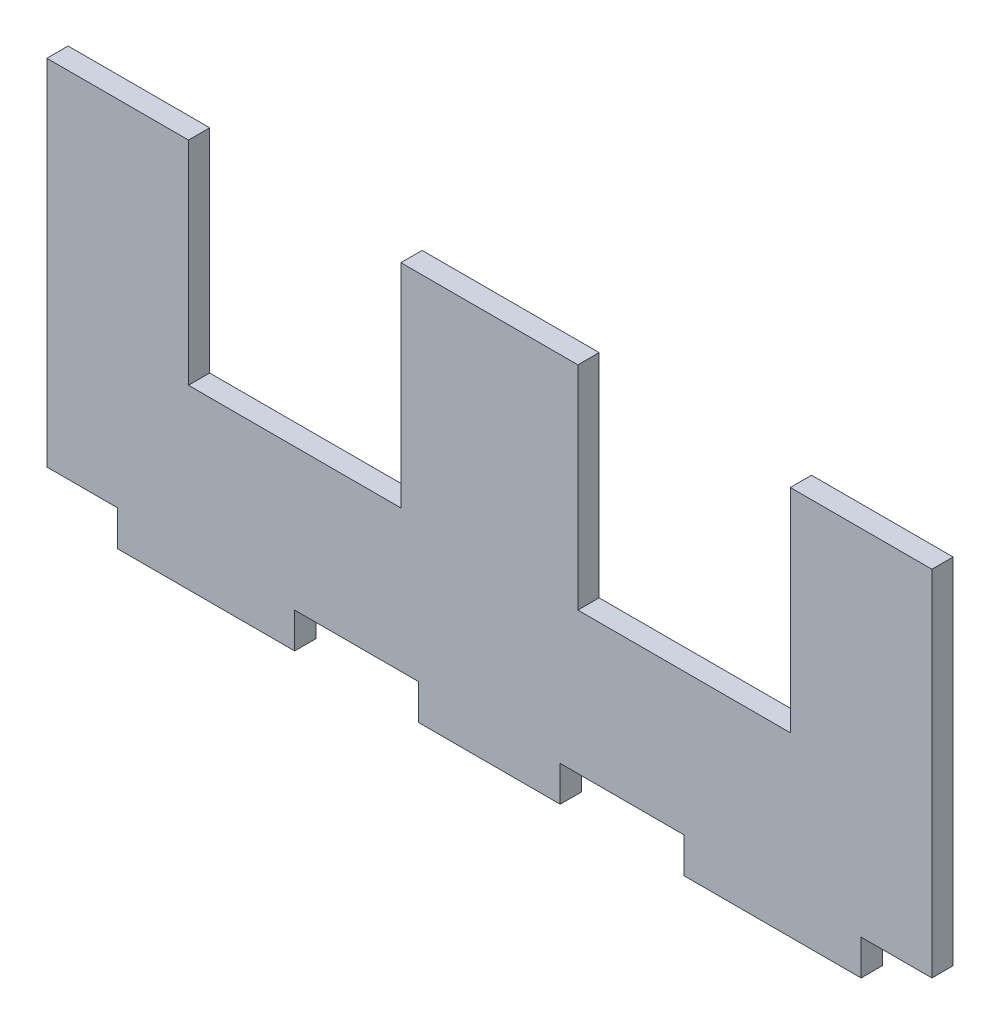
ISO-10303-21;
HEADER;
FILE_DESCRIPTION(('STEP AP214'),'2;1');
FILE_NAME('part.step','',(''),(''),'','','');
FILE_SCHEMA(('AUTOMOTIVE_DESIGN { 1 0 10303 214 1 1 1 1 }'));
ENDSEC;
DATA;
#1=APPLICATION_CONTEXT('core data for automotive mechanical design processes');
#2=APPLICATION_PROTOCOL_DEFINITION('international standard','automotive_design',2000,#1);
#3=PRODUCT_CONTEXT('',#1,'mechanical');
#4=PRODUCT('Part','Part','',(#3));
#5=PRODUCT_RELATED_PRODUCT_CATEGORY('part','',(#4));
#6=PRODUCT_DEFINITION_FORMATION('','',#4);
#7=PRODUCT_DEFINITION_CONTEXT('part definition',#1,'design');
#8=PRODUCT_DEFINITION('design','',#6,#7);
#9=PRODUCT_DEFINITION_SHAPE('','',#8);
#10=(LENGTH_UNIT() NAMED_UNIT(*) SI_UNIT(.MILLI.,.METRE.));
#11=(NAMED_UNIT(*) PLANE_ANGLE_UNIT() SI_UNIT($,.RADIAN.));
#12=(NAMED_UNIT(*) SI_UNIT($,.STERADIAN.) SOLID_ANGLE_UNIT());
#13=UNCERTAINTY_MEASURE_WITH_UNIT(LENGTH_MEASURE(1.E-05),#10,'distance_accuracy_value','');
#14=(GEOMETRIC_REPRESENTATION_CONTEXT(3) GLOBAL_UNCERTAINTY_ASSIGNED_CONTEXT((#13)) GLOBAL_UNIT_ASSIGNED_CONTEXT((#10,
#11,#12)) REPRESENTATION_CONTEXT('',''));
#15=CARTESIAN_POINT('',(0.,0.,0.));
#16=DIRECTION('',(0.,0.,1.));
#17=DIRECTION('',(1.,0.,0.));
#18=AXIS2_PLACEMENT_3D('',#15,#16,#17);
#19=CARTESIAN_POINT('',(-73.4907773117798,27.1036585365854,3.));
#20=DIRECTION('',(0.,-1.,0.));
#21=DIRECTION('',(0.,0.,-1.));
#22=AXIS2_PLACEMENT_3D('',#19,#20,#21);
#23=PLANE('',#22);
#24=DIRECTION('',(-1.,0.,0.));
#25=VECTOR('',#24,1.);
#26=CARTESIAN_POINT('',(-73.4907773117798,27.1036585365854,3.));
#27=LINE('',#26,#25);
#28=CARTESIAN_POINT('',(-53.4907773117798,27.1036585365854,3.));
#29=VERTEX_POINT('',#28);
#30=CARTESIAN_POINT('',(-73.4907773117798,27.1036585365854,3.));
#31=VERTEX_POINT('',#30);
#32=EDGE_CURVE('E209',#29,#31,#27,.T.);
#33=ORIENTED_EDGE('',*,*,#32,.F.);
#34=DIRECTION('',(0.,0.,-1.));
#35=VECTOR('',#34,1.);
#36=CARTESIAN_POINT('',(-53.4907773117798,27.1036585365854,3.));
#37=LINE('',#36,#35);
#38=CARTESIAN_POINT('',(-53.4907773117798,27.1036585365854,0.));
#39=VERTEX_POINT('',#38);
#40=EDGE_CURVE('E194',#29,#39,#37,.T.);
#41=ORIENTED_EDGE('',*,*,#40,.T.);
#42=DIRECTION('',(-1.,0.,0.));
#43=VECTOR('',#42,1.);
#44=CARTESIAN_POINT('',(-73.4907773117798,27.1036585365854,0.));
#45=LINE('',#44,#43);
#46=CARTESIAN_POINT('',(-73.4907773117798,27.1036585365854,0.));
#47=VERTEX_POINT('',#46);
#48=EDGE_CURVE('E317',#39,#47,#45,.T.);
#49=ORIENTED_EDGE('',*,*,#48,.T.);
#50=DIRECTION('',(0.,0.,-1.));
#51=VECTOR('',#50,1.);
#52=CARTESIAN_POINT('',(-73.4907773117798,27.1036585365854,3.));
#53=LINE('',#52,#51);
#54=EDGE_CURVE('E217',#31,#47,#53,.T.);
#55=ORIENTED_EDGE('',*,*,#54,.F.);
#56=EDGE_LOOP('',(#33,#41,#49,#55));
#57=FACE_BOUND('',#56,.T.);
#58=ADVANCED_FACE('F32',(#57),#23,.F.);
#59=CARTESIAN_POINT('',(51.5092226882202,27.1036585365854,0.));
#60=VERTEX_POINT('',#59);
#61=CARTESIAN_POINT('',(31.5092226882202,27.1036585365854,0.));
#62=VERTEX_POINT('',#61);
#63=EDGE_CURVE('E239',#60,#62,#45,.T.);
#64=ORIENTED_EDGE('',*,*,#63,.T.);
#65=DIRECTION('',(0.,0.,-1.));
#66=VECTOR('',#65,1.);
#67=CARTESIAN_POINT('',(31.5092226882202,27.1036585365854,3.));
#68=LINE('',#67,#66);
#69=CARTESIAN_POINT('',(31.5092226882202,27.1036585365854,3.));
#70=VERTEX_POINT('',#69);
#71=EDGE_CURVE('E367',#70,#62,#68,.T.);
#72=ORIENTED_EDGE('',*,*,#71,.F.);
#73=CARTESIAN_POINT('',(51.5092226882202,27.1036585365854,3.));
#74=VERTEX_POINT('',#73);
#75=EDGE_CURVE('E222',#74,#70,#27,.T.);
#76=ORIENTED_EDGE('',*,*,#75,.F.);
#77=DIRECTION('',(0.,0.,-1.));
#78=VECTOR('',#77,1.);
#79=CARTESIAN_POINT('',(51.5092226882202,27.1036585365854,3.));
#80=LINE('',#79,#78);
#81=EDGE_CURVE('E230',#74,#60,#80,.T.);
#82=ORIENTED_EDGE('',*,*,#81,.T.);
#83=EDGE_LOOP('',(#64,#72,#76,#82));
#84=FACE_BOUND('',#83,.T.);
#85=ADVANCED_FACE('F366',(#84),#23,.F.);
#86=CARTESIAN_POINT('',(-73.4907773117798,27.1036585365854,3.));
#87=DIRECTION('',(1.,0.,0.));
#88=DIRECTION('',(0.,1.,0.));
#89=AXIS2_PLACEMENT_3D('',#86,#87,#88);
#90=PLANE('',#89);
#91=DIRECTION('',(0.,-1.,0.));
#92=VECTOR('',#91,1.);
#93=CARTESIAN_POINT('',(-73.4907773117798,27.1036585365854,0.));
#94=LINE('',#93,#92);
#95=CARTESIAN_POINT('',(-73.4907773117798,-22.8963414634146,0.));
#96=VERTEX_POINT('',#95);
#97=EDGE_CURVE('E295',#47,#96,#94,.T.);
#98=ORIENTED_EDGE('',*,*,#97,.T.);
#99=DIRECTION('',(0.,0.,-1.));
#100=VECTOR('',#99,1.);
#101=CARTESIAN_POINT('',(-73.4907773117798,-22.8963414634146,3.));
#102=LINE('',#101,#100);
#103=CARTESIAN_POINT('',(-73.4907773117798,-22.8963414634146,3.));
#104=VERTEX_POINT('',#103);
#105=EDGE_CURVE('E11',#104,#96,#102,.T.);
#106=ORIENTED_EDGE('',*,*,#105,.F.);
#107=DIRECTION('',(0.,-1.,0.));
#108=VECTOR('',#107,1.);
#109=CARTESIAN_POINT('',(-73.4907773117798,27.1036585365854,3.));
#110=LINE('',#109,#108);
#111=EDGE_CURVE('E324',#31,#104,#110,.T.);
#112=ORIENTED_EDGE('',*,*,#111,.F.);
#113=ORIENTED_EDGE('',*,*,#54,.T.);
#114=EDGE_LOOP('',(#98,#106,#112,#113));
#115=FACE_BOUND('',#114,.T.);
#116=ADVANCED_FACE('F34',(#115),#90,.F.);
#117=CARTESIAN_POINT('',(-73.4907773117798,-22.8963414634146,3.));
#118=DIRECTION('',(0.,1.,0.));
#119=DIRECTION('',(-1.,0.,0.));
#120=AXIS2_PLACEMENT_3D('',#117,#118,#119);
#121=PLANE('',#120);
#122=DIRECTION('',(1.,0.,0.));
#123=VECTOR('',#122,1.);
#124=CARTESIAN_POINT('',(-73.4907773117798,-22.8963414634146,0.));
#125=LINE('',#124,#123);
#126=CARTESIAN_POINT('',(-63.4907773117798,-22.8963414634146,0.));
#127=VERTEX_POINT('',#126);
#128=EDGE_CURVE('E289',#96,#127,#125,.T.);
#129=ORIENTED_EDGE('',*,*,#128,.T.);
#130=DIRECTION('',(0.,0.,-1.));
#131=VECTOR('',#130,1.);
#132=CARTESIAN_POINT('',(-63.4907773117798,-22.8963414634146,3.));
#133=LINE('',#132,#131);
#134=CARTESIAN_POINT('',(-63.4907773117798,-22.8963414634146,3.));
#135=VERTEX_POINT('',#134);
#136=EDGE_CURVE('E40',#135,#127,#133,.T.);
#137=ORIENTED_EDGE('',*,*,#136,.F.);
#138=DIRECTION('',(1.,0.,0.));
#139=VECTOR('',#138,1.);
#140=CARTESIAN_POINT('',(-73.4907773117798,-22.8963414634146,3.));
#141=LINE('',#140,#139);
#142=EDGE_CURVE('E328',#104,#135,#141,.T.);
#143=ORIENTED_EDGE('',*,*,#142,.F.);
#144=ORIENTED_EDGE('',*,*,#105,.T.);
#145=EDGE_LOOP('',(#129,#137,#143,#144));
#146=FACE_BOUND('',#145,.T.);
#147=ADVANCED_FACE('F481',(#146),#121,.F.);
#148=CARTESIAN_POINT('',(-63.4907773117798,-22.8963414634146,3.));
#149=DIRECTION('',(1.,0.,0.));
#150=DIRECTION('',(0.,1.,0.));
#151=AXIS2_PLACEMENT_3D('',#148,#149,#150);
#152=PLANE('',#151);
#153=DIRECTION('',(0.,-1.,0.));
#154=VECTOR('',#153,1.);
#155=CARTESIAN_POINT('',(-63.4907773117798,-22.8963414634146,0.));
#156=LINE('',#155,#154);
#157=CARTESIAN_POINT('',(-63.4907773117798,-27.8963414634146,0.));
#158=VERTEX_POINT('',#157);
#159=EDGE_CURVE('E283',#127,#158,#156,.T.);
#160=ORIENTED_EDGE('',*,*,#159,.T.);
#161=DIRECTION('',(0.,0.,-1.));
#162=VECTOR('',#161,1.);
#163=CARTESIAN_POINT('',(-63.4907773117798,-27.8963414634146,3.));
#164=LINE('',#163,#162);
#165=CARTESIAN_POINT('',(-63.4907773117798,-27.8963414634146,3.));
#166=VERTEX_POINT('',#165);
#167=EDGE_CURVE('E274',#166,#158,#164,.T.);
#168=ORIENTED_EDGE('',*,*,#167,.F.);
#169=DIRECTION('',(0.,-1.,0.));
#170=VECTOR('',#169,1.);
#171=CARTESIAN_POINT('',(-63.4907773117798,-22.8963414634146,3.));
#172=LINE('',#171,#170);
#173=EDGE_CURVE('E284',#135,#166,#172,.T.);
#174=ORIENTED_EDGE('',*,*,#173,.F.);
#175=ORIENTED_EDGE('',*,*,#136,.T.);
#176=EDGE_LOOP('',(#160,#168,#174,#175));
#177=FACE_BOUND('',#176,.T.);
#178=ADVANCED_FACE('F281',(#177),#152,.F.);
#179=CARTESIAN_POINT('',(-63.4907773117798,-27.8963414634146,3.));
#180=DIRECTION('',(0.,1.,0.));
#181=DIRECTION('',(0.,0.,1.));
#182=AXIS2_PLACEMENT_3D('',#179,#180,#181);
#183=PLANE('',#182);
#184=DIRECTION('',(1.,0.,0.));
#185=VECTOR('',#184,1.);
#186=CARTESIAN_POINT('',(-63.4907773117798,-27.8963414634146,0.));
#187=LINE('',#186,#185);
#188=CARTESIAN_POINT('',(-38.4907773117798,-27.8963414634146,0.));
#189=VERTEX_POINT('',#188);
#190=EDGE_CURVE('E291',#158,#189,#187,.T.);
#191=ORIENTED_EDGE('',*,*,#190,.T.);
#192=DIRECTION('',(0.,0.,-1.));
#193=VECTOR('',#192,1.);
#194=CARTESIAN_POINT('',(-38.4907773117798,-27.8963414634146,3.));
#195=LINE('',#194,#193);
#196=CARTESIAN_POINT('',(-38.4907773117798,-27.8963414634146,3.));
#197=VERTEX_POINT('',#196);
#198=EDGE_CURVE('E271',#197,#189,#195,.T.);
#199=ORIENTED_EDGE('',*,*,#198,.F.);
#200=DIRECTION('',(1.,0.,0.));
#201=VECTOR('',#200,1.);
#202=CARTESIAN_POINT('',(-63.4907773117798,-27.8963414634146,3.));
#203=LINE('',#202,#201);
#204=EDGE_CURVE('E337',#166,#197,#203,.T.);
#205=ORIENTED_EDGE('',*,*,#204,.F.);
#206=ORIENTED_EDGE('',*,*,#167,.T.);
#207=EDGE_LOOP('',(#191,#199,#205,#206));
#208=FACE_BOUND('',#207,.T.);
#209=ADVANCED_FACE('F475',(#208),#183,.F.);
#210=CARTESIAN_POINT('',(-38.4907773117798,-22.8963414634146,3.));
#211=DIRECTION('',(-1.,0.,0.));
#212=DIRECTION('',(0.,0.,1.));
#213=AXIS2_PLACEMENT_3D('',#210,#211,#212);
#214=PLANE('',#213);
#215=DIRECTION('',(0.,1.,0.));
#216=VECTOR('',#215,1.);
#217=CARTESIAN_POINT('',(-38.4907773117798,-22.8963414634146,0.));
#218=LINE('',#217,#216);
#219=CARTESIAN_POINT('',(-38.4907773117798,-22.8963414634146,0.));
#220=VERTEX_POINT('',#219);
#221=EDGE_CURVE('E293',#189,#220,#218,.T.);
#222=ORIENTED_EDGE('',*,*,#221,.T.);
#223=DIRECTION('',(0.,0.,-1.));
#224=VECTOR('',#223,1.);
#225=CARTESIAN_POINT('',(-38.4907773117798,-22.8963414634146,3.));
#226=LINE('',#225,#224);
#227=CARTESIAN_POINT('',(-38.4907773117798,-22.8963414634146,3.));
#228=VERTEX_POINT('',#227);
#229=EDGE_CURVE('E268',#228,#220,#226,.T.);
#230=ORIENTED_EDGE('',*,*,#229,.F.);
#231=DIRECTION('',(0.,1.,0.));
#232=VECTOR('',#231,1.);
#233=CARTESIAN_POINT('',(-38.4907773117798,-22.8963414634146,3.));
#234=LINE('',#233,#232);
#235=EDGE_CURVE('E339',#197,#228,#234,.T.);
#236=ORIENTED_EDGE('',*,*,#235,.F.);
#237=ORIENTED_EDGE('',*,*,#198,.T.);
#238=EDGE_LOOP('',(#222,#230,#236,#237));
#239=FACE_BOUND('',#238,.T.);
#240=ADVANCED_FACE('F471',(#239),#214,.F.);
#241=CARTESIAN_POINT('',(-38.4907773117798,-22.8963414634146,3.));
#242=DIRECTION('',(0.,1.,0.));
#243=DIRECTION('',(0.,0.,1.));
#244=AXIS2_PLACEMENT_3D('',#241,#242,#243);
#245=PLANE('',#244);
#246=DIRECTION('',(1.,0.,0.));
#247=VECTOR('',#246,1.);
#248=CARTESIAN_POINT('',(-38.4907773117798,-22.8963414634146,0.));
#249=LINE('',#248,#247);
#250=CARTESIAN_POINT('',(-20.9907773117798,-22.8963414634146,0.));
#251=VERTEX_POINT('',#250);
#252=EDGE_CURVE('E299',#220,#251,#249,.T.);
#253=ORIENTED_EDGE('',*,*,#252,.T.);
#254=DIRECTION('',(0.,0.,-1.));
#255=VECTOR('',#254,1.);
#256=CARTESIAN_POINT('',(-20.9907773117798,-22.8963414634146,3.));
#257=LINE('',#256,#255);
#258=CARTESIAN_POINT('',(-20.9907773117798,-22.8963414634146,3.));
#259=VERTEX_POINT('',#258);
#260=EDGE_CURVE('E265',#259,#251,#257,.T.);
#261=ORIENTED_EDGE('',*,*,#260,.F.);
#262=DIRECTION('',(1.,0.,0.));
#263=VECTOR('',#262,1.);
#264=CARTESIAN_POINT('',(-38.4907773117798,-22.8963414634146,3.));
#265=LINE('',#264,#263);
#266=EDGE_CURVE('E341',#228,#259,#265,.T.);
#267=ORIENTED_EDGE('',*,*,#266,.F.);
#268=ORIENTED_EDGE('',*,*,#229,.T.);
#269=EDGE_LOOP('',(#253,#261,#267,#268));
#270=FACE_BOUND('',#269,.T.);
#271=ADVANCED_FACE('F467',(#270),#245,.F.);
#272=CARTESIAN_POINT('',(-20.9907773117798,-22.8963414634146,3.));
#273=DIRECTION('',(1.,0.,0.));
#274=DIRECTION('',(0.,0.,-1.));
#275=AXIS2_PLACEMENT_3D('',#272,#273,#274);
#276=PLANE('',#275);
#277=DIRECTION('',(0.,-1.,0.));
#278=VECTOR('',#277,1.);
#279=CARTESIAN_POINT('',(-20.9907773117798,-22.8963414634146,0.));
#280=LINE('',#279,#278);
#281=CARTESIAN_POINT('',(-20.9907773117798,-27.8963414634146,0.));
#282=VERTEX_POINT('',#281);
#283=EDGE_CURVE('E301',#251,#282,#280,.T.);
#284=ORIENTED_EDGE('',*,*,#283,.T.);
#285=DIRECTION('',(0.,0.,-1.));
#286=VECTOR('',#285,1.);
#287=CARTESIAN_POINT('',(-20.9907773117798,-27.8963414634146,3.));
#288=LINE('',#287,#286);
#289=CARTESIAN_POINT('',(-20.9907773117798,-27.8963414634146,3.));
#290=VERTEX_POINT('',#289);
#291=EDGE_CURVE('E262',#290,#282,#288,.T.);
#292=ORIENTED_EDGE('',*,*,#291,.F.);
#293=DIRECTION('',(0.,-1.,0.));
#294=VECTOR('',#293,1.);
#295=CARTESIAN_POINT('',(-20.9907773117798,-22.8963414634146,3.));
#296=LINE('',#295,#294);
#297=EDGE_CURVE('E343',#259,#290,#296,.T.);
#298=ORIENTED_EDGE('',*,*,#297,.F.);
#299=ORIENTED_EDGE('',*,*,#260,.T.);
#300=EDGE_LOOP('',(#284,#292,#298,#299));
#301=FACE_BOUND('',#300,.T.);
#302=ADVANCED_FACE('F463',(#301),#276,.F.);
#303=CARTESIAN_POINT('',(-20.9907773117798,-27.8963414634146,3.));
#304=DIRECTION('',(0.,1.,0.));
#305=DIRECTION('',(-1.,0.,0.));
#306=AXIS2_PLACEMENT_3D('',#303,#304,#305);
#307=PLANE('',#306);
#308=DIRECTION('',(1.,0.,0.));
#309=VECTOR('',#308,1.);
#310=CARTESIAN_POINT('',(-20.9907773117798,-27.8963414634146,0.));
#311=LINE('',#310,#309);
#312=CARTESIAN_POINT('',(-0.990777311779784,-27.8963414634146,0.));
#313=VERTEX_POINT('',#312);
#314=EDGE_CURVE('E303',#282,#313,#311,.T.);
#315=ORIENTED_EDGE('',*,*,#314,.T.);
#316=DIRECTION('',(0.,0.,-1.));
#317=VECTOR('',#316,1.);
#318=CARTESIAN_POINT('',(-0.990777311779784,-27.8963414634146,3.));
#319=LINE('',#318,#317);
#320=CARTESIAN_POINT('',(-0.990777311779784,-27.8963414634146,3.));
#321=VERTEX_POINT('',#320);
#322=EDGE_CURVE('E259',#321,#313,#319,.T.);
#323=ORIENTED_EDGE('',*,*,#322,.F.);
#324=DIRECTION('',(1.,0.,0.));
#325=VECTOR('',#324,1.);
#326=CARTESIAN_POINT('',(-20.9907773117798,-27.8963414634146,3.));
#327=LINE('',#326,#325);
#328=EDGE_CURVE('E345',#290,#321,#327,.T.);
#329=ORIENTED_EDGE('',*,*,#328,.F.);
#330=ORIENTED_EDGE('',*,*,#291,.T.);
#331=EDGE_LOOP('',(#315,#323,#329,#330));
#332=FACE_BOUND('',#331,.T.);
#333=ADVANCED_FACE('F459',(#332),#307,.F.);
#334=CARTESIAN_POINT('',(-0.990777311779789,-22.8963414634146,3.));
#335=DIRECTION('',(-1.,0.,0.));
#336=DIRECTION('',(0.,-1.,0.));
#337=AXIS2_PLACEMENT_3D('',#334,#335,#336);
#338=PLANE('',#337);
#339=DIRECTION('',(0.,1.,0.));
#340=VECTOR('',#339,1.);
#341=CARTESIAN_POINT('',(-0.990777311779789,-22.8963414634146,0.));
#342=LINE('',#341,#340);
#343=CARTESIAN_POINT('',(-0.990777311779789,-22.8963414634146,0.));
#344=VERTEX_POINT('',#343);
#345=EDGE_CURVE('E305',#313,#344,#342,.T.);
#346=ORIENTED_EDGE('',*,*,#345,.T.);
#347=DIRECTION('',(0.,0.,-1.));
#348=VECTOR('',#347,1.);
#349=CARTESIAN_POINT('',(-0.990777311779789,-22.8963414634146,3.));
#350=LINE('',#349,#348);
#351=CARTESIAN_POINT('',(-0.990777311779789,-22.8963414634146,3.));
#352=VERTEX_POINT('',#351);
#353=EDGE_CURVE('E256',#352,#344,#350,.T.);
#354=ORIENTED_EDGE('',*,*,#353,.F.);
#355=DIRECTION('',(0.,1.,0.));
#356=VECTOR('',#355,1.);
#357=CARTESIAN_POINT('',(-0.990777311779789,-22.8963414634146,3.));
#358=LINE('',#357,#356);
#359=EDGE_CURVE('E347',#321,#352,#358,.T.);
#360=ORIENTED_EDGE('',*,*,#359,.F.);
#361=ORIENTED_EDGE('',*,*,#322,.T.);
#362=EDGE_LOOP('',(#346,#354,#360,#361));
#363=FACE_BOUND('',#362,.T.);
#364=ADVANCED_FACE('F455',(#363),#338,.F.);
#365=CARTESIAN_POINT('',(-0.990777311779789,-22.8963414634146,3.));
#366=DIRECTION('',(0.,1.,0.));
#367=DIRECTION('',(-1.,0.,0.));
#368=AXIS2_PLACEMENT_3D('',#365,#366,#367);
#369=PLANE('',#368);
#370=DIRECTION('',(1.,0.,0.));
#371=VECTOR('',#370,1.);
#372=CARTESIAN_POINT('',(-0.990777311779789,-22.8963414634146,0.));
#373=LINE('',#372,#371);
#374=CARTESIAN_POINT('',(16.5092226882202,-22.8963414634146,0.));
#375=VERTEX_POINT('',#374);
#376=EDGE_CURVE('E307',#344,#375,#373,.T.);
#377=ORIENTED_EDGE('',*,*,#376,.T.);
#378=DIRECTION('',(0.,0.,-1.));
#379=VECTOR('',#378,1.);
#380=CARTESIAN_POINT('',(16.5092226882202,-22.8963414634146,3.));
#381=LINE('',#380,#379);
#382=CARTESIAN_POINT('',(16.5092226882202,-22.8963414634146,3.));
#383=VERTEX_POINT('',#382);
#384=EDGE_CURVE('E253',#383,#375,#381,.T.);
#385=ORIENTED_EDGE('',*,*,#384,.F.);
#386=DIRECTION('',(1.,0.,0.));
#387=VECTOR('',#386,1.);
#388=CARTESIAN_POINT('',(-0.990777311779789,-22.8963414634146,3.));
#389=LINE('',#388,#387);
#390=EDGE_CURVE('E349',#352,#383,#389,.T.);
#391=ORIENTED_EDGE('',*,*,#390,.F.);
#392=ORIENTED_EDGE('',*,*,#353,.T.);
#393=EDGE_LOOP('',(#377,#385,#391,#392));
#394=FACE_BOUND('',#393,.T.);
#395=ADVANCED_FACE('F451',(#394),#369,.F.);
#396=CARTESIAN_POINT('',(16.5092226882202,-22.8963414634146,3.));
#397=DIRECTION('',(1.,0.,0.));
#398=DIRECTION('',(0.,0.,-1.));
#399=AXIS2_PLACEMENT_3D('',#396,#397,#398);
#400=PLANE('',#399);
#401=DIRECTION('',(0.,-1.,0.));
#402=VECTOR('',#401,1.);
#403=CARTESIAN_POINT('',(16.5092226882202,-22.8963414634146,0.));
#404=LINE('',#403,#402);
#405=CARTESIAN_POINT('',(16.5092226882202,-27.8963414634147,0.));
#406=VERTEX_POINT('',#405);
#407=EDGE_CURVE('E309',#375,#406,#404,.T.);
#408=ORIENTED_EDGE('',*,*,#407,.T.);
#409=DIRECTION('',(0.,0.,-1.));
#410=VECTOR('',#409,1.);
#411=CARTESIAN_POINT('',(16.5092226882202,-27.8963414634147,3.));
#412=LINE('',#411,#410);
#413=CARTESIAN_POINT('',(16.5092226882202,-27.8963414634147,3.));
#414=VERTEX_POINT('',#413);
#415=EDGE_CURVE('E250',#414,#406,#412,.T.);
#416=ORIENTED_EDGE('',*,*,#415,.F.);
#417=DIRECTION('',(0.,-1.,0.));
#418=VECTOR('',#417,1.);
#419=CARTESIAN_POINT('',(16.5092226882202,-22.8963414634146,3.));
#420=LINE('',#419,#418);
#421=EDGE_CURVE('E351',#383,#414,#420,.T.);
#422=ORIENTED_EDGE('',*,*,#421,.F.);
#423=ORIENTED_EDGE('',*,*,#384,.T.);
#424=EDGE_LOOP('',(#408,#416,#422,#423));
#425=FACE_BOUND('',#424,.T.);
#426=ADVANCED_FACE('F447',(#425),#400,.F.);
#427=CARTESIAN_POINT('',(16.5092226882202,-27.8963414634147,3.));
#428=DIRECTION('',(0.,1.,0.));
#429=DIRECTION('',(-1.,0.,0.));
#430=AXIS2_PLACEMENT_3D('',#427,#428,#429);
#431=PLANE('',#430);
#432=DIRECTION('',(1.,0.,0.));
#433=VECTOR('',#432,1.);
#434=CARTESIAN_POINT('',(16.5092226882202,-27.8963414634147,0.));
#435=LINE('',#434,#433);
#436=CARTESIAN_POINT('',(41.5092226882202,-27.8963414634146,0.));
#437=VERTEX_POINT('',#436);
#438=EDGE_CURVE('E311',#406,#437,#435,.T.);
#439=ORIENTED_EDGE('',*,*,#438,.T.);
#440=DIRECTION('',(0.,0.,-1.));
#441=VECTOR('',#440,1.);
#442=CARTESIAN_POINT('',(41.5092226882202,-27.8963414634146,3.));
#443=LINE('',#442,#441);
#444=CARTESIAN_POINT('',(41.5092226882202,-27.8963414634146,3.));
#445=VERTEX_POINT('',#444);
#446=EDGE_CURVE('E247',#445,#437,#443,.T.);
#447=ORIENTED_EDGE('',*,*,#446,.F.);
#448=DIRECTION('',(1.,0.,0.));
#449=VECTOR('',#448,1.);
#450=CARTESIAN_POINT('',(16.5092226882202,-27.8963414634147,3.));
#451=LINE('',#450,#449);
#452=EDGE_CURVE('E353',#414,#445,#451,.T.);
#453=ORIENTED_EDGE('',*,*,#452,.F.);
#454=ORIENTED_EDGE('',*,*,#415,.T.);
#455=EDGE_LOOP('',(#439,#447,#453,#454));
#456=FACE_BOUND('',#455,.T.);
#457=ADVANCED_FACE('F443',(#456),#431,.F.);
#458=CARTESIAN_POINT('',(41.5092226882202,-22.8963414634146,3.));
#459=DIRECTION('',(-1.,0.,0.));
#460=DIRECTION('',(0.,0.,1.));
#461=AXIS2_PLACEMENT_3D('',#458,#459,#460);
#462=PLANE('',#461);
#463=DIRECTION('',(0.,1.,0.));
#464=VECTOR('',#463,1.);
#465=CARTESIAN_POINT('',(41.5092226882202,-22.8963414634146,0.));
#466=LINE('',#465,#464);
#467=CARTESIAN_POINT('',(41.5092226882202,-22.8963414634146,0.));
#468=VERTEX_POINT('',#467);
#469=EDGE_CURVE('E313',#437,#468,#466,.T.);
#470=ORIENTED_EDGE('',*,*,#469,.T.);
#471=DIRECTION('',(0.,0.,-1.));
#472=VECTOR('',#471,1.);
#473=CARTESIAN_POINT('',(41.5092226882202,-22.8963414634146,3.));
#474=LINE('',#473,#472);
#475=CARTESIAN_POINT('',(41.5092226882202,-22.8963414634146,3.));
#476=VERTEX_POINT('',#475);
#477=EDGE_CURVE('E244',#476,#468,#474,.T.);
#478=ORIENTED_EDGE('',*,*,#477,.F.);
#479=DIRECTION('',(0.,1.,0.));
#480=VECTOR('',#479,1.);
#481=CARTESIAN_POINT('',(41.5092226882202,-22.8963414634146,3.));
#482=LINE('',#481,#480);
#483=EDGE_CURVE('E355',#445,#476,#482,.T.);
#484=ORIENTED_EDGE('',*,*,#483,.F.);
#485=ORIENTED_EDGE('',*,*,#446,.T.);
#486=EDGE_LOOP('',(#470,#478,#484,#485));
#487=FACE_BOUND('',#486,.T.);
#488=ADVANCED_FACE('F438',(#487),#462,.F.);
#489=CARTESIAN_POINT('',(41.5092226882202,-22.8963414634146,3.));
#490=DIRECTION('',(0.,1.,0.));
#491=DIRECTION('',(-1.,0.,0.));
#492=AXIS2_PLACEMENT_3D('',#489,#490,#491);
#493=PLANE('',#492);
#494=DIRECTION('',(1.,0.,0.));
#495=VECTOR('',#494,1.);
#496=CARTESIAN_POINT('',(41.5092226882202,-22.8963414634146,0.));
#497=LINE('',#496,#495);
#498=CARTESIAN_POINT('',(51.5092226882202,-22.8963414634146,0.));
#499=VERTEX_POINT('',#498);
#500=EDGE_CURVE('E315',#468,#499,#497,.T.);
#501=ORIENTED_EDGE('',*,*,#500,.T.);
#502=DIRECTION('',(0.,0.,-1.));
#503=VECTOR('',#502,1.);
#504=CARTESIAN_POINT('',(51.5092226882202,-22.8963414634146,3.));
#505=LINE('',#504,#503);
#506=CARTESIAN_POINT('',(51.5092226882202,-22.8963414634146,3.));
#507=VERTEX_POINT('',#506);
#508=EDGE_CURVE('E236',#507,#499,#505,.T.);
#509=ORIENTED_EDGE('',*,*,#508,.F.);
#510=DIRECTION('',(1.,0.,0.));
#511=VECTOR('',#510,1.);
#512=CARTESIAN_POINT('',(41.5092226882202,-22.8963414634146,3.));
#513=LINE('',#512,#511);
#514=EDGE_CURVE('E224',#476,#507,#513,.T.);
#515=ORIENTED_EDGE('',*,*,#514,.F.);
#516=ORIENTED_EDGE('',*,*,#477,.T.);
#517=EDGE_LOOP('',(#501,#509,#515,#516));
#518=FACE_BOUND('',#517,.T.);
#519=ADVANCED_FACE('F363',(#518),#493,.F.);
#520=CARTESIAN_POINT('',(51.5092226882202,27.1036585365854,3.));
#521=DIRECTION('',(-1.,0.,0.));
#522=DIRECTION('',(0.,-1.,0.));
#523=AXIS2_PLACEMENT_3D('',#520,#521,#522);
#524=PLANE('',#523);
#525=DIRECTION('',(0.,1.,0.));
#526=VECTOR('',#525,1.);
#527=CARTESIAN_POINT('',(51.5092226882202,27.1036585365854,0.));
#528=LINE('',#527,#526);
#529=EDGE_CURVE('E316',#499,#60,#528,.T.);
#530=ORIENTED_EDGE('',*,*,#529,.T.);
#531=ORIENTED_EDGE('',*,*,#81,.F.);
#532=DIRECTION('',(0.,1.,0.));
#533=VECTOR('',#532,1.);
#534=CARTESIAN_POINT('',(51.5092226882202,27.1036585365854,3.));
#535=LINE('',#534,#533);
#536=EDGE_CURVE('E220',#507,#74,#535,.T.);
#537=ORIENTED_EDGE('',*,*,#536,.F.);
#538=ORIENTED_EDGE('',*,*,#508,.T.);
#539=EDGE_LOOP('',(#530,#531,#537,#538));
#540=FACE_BOUND('',#539,.T.);
#541=ADVANCED_FACE('F365',(#540),#524,.F.);
#542=CARTESIAN_POINT('',(1.50922268822017,27.1036585365854,0.));
#543=VERTEX_POINT('',#542);
#544=CARTESIAN_POINT('',(-23.4907773117798,27.1036585365854,0.));
#545=VERTEX_POINT('',#544);
#546=EDGE_CURVE('E321',#543,#545,#45,.T.);
#547=ORIENTED_EDGE('',*,*,#546,.T.);
#548=DIRECTION('',(0.,0.,-1.));
#549=VECTOR('',#548,1.);
#550=CARTESIAN_POINT('',(-23.4907773117798,27.1036585365854,3.));
#551=LINE('',#550,#549);
#552=CARTESIAN_POINT('',(-23.4907773117798,27.1036585365854,3.));
#553=VERTEX_POINT('',#552);
#554=EDGE_CURVE('E47',#553,#545,#551,.T.);
#555=ORIENTED_EDGE('',*,*,#554,.F.);
#556=CARTESIAN_POINT('',(1.50922268822017,27.1036585365854,3.));
#557=VERTEX_POINT('',#556);
#558=EDGE_CURVE('E219',#557,#553,#27,.T.);
#559=ORIENTED_EDGE('',*,*,#558,.F.);
#560=DIRECTION('',(0.,0.,-1.));
#561=VECTOR('',#560,1.);
#562=CARTESIAN_POINT('',(1.50922268822017,27.1036585365854,3.));
#563=LINE('',#562,#561);
#564=EDGE_CURVE('E368',#557,#543,#563,.T.);
#565=ORIENTED_EDGE('',*,*,#564,.T.);
#566=EDGE_LOOP('',(#547,#555,#559,#565));
#567=FACE_BOUND('',#566,.T.);
#568=ADVANCED_FACE('F408',(#567),#23,.F.);
#569=CARTESIAN_POINT('',(0.,0.,3.));
#570=DIRECTION('',(0.,0.,1.));
#571=DIRECTION('',(1.,0.,0.));
#572=AXIS2_PLACEMENT_3D('',#569,#570,#571);
#573=PLANE('',#572);
#574=DIRECTION('',(0.,1.,0.));
#575=VECTOR('',#574,1.);
#576=CARTESIAN_POINT('',(-53.4907773117798,-2.89634146341465,3.));
#577=LINE('',#576,#575);
#578=CARTESIAN_POINT('',(-53.4907773117798,-2.89634146341465,3.));
#579=VERTEX_POINT('',#578);
#580=EDGE_CURVE('E197',#579,#29,#577,.T.);
#581=ORIENTED_EDGE('',*,*,#580,.T.);
#582=ORIENTED_EDGE('',*,*,#32,.T.);
#583=ORIENTED_EDGE('',*,*,#111,.T.);
#584=ORIENTED_EDGE('',*,*,#142,.T.);
#585=ORIENTED_EDGE('',*,*,#173,.T.);
#586=ORIENTED_EDGE('',*,*,#204,.T.);
#587=ORIENTED_EDGE('',*,*,#235,.T.);
#588=ORIENTED_EDGE('',*,*,#266,.T.);
#589=ORIENTED_EDGE('',*,*,#297,.T.);
#590=ORIENTED_EDGE('',*,*,#328,.T.);
#591=ORIENTED_EDGE('',*,*,#359,.T.);
#592=ORIENTED_EDGE('',*,*,#390,.T.);
#593=ORIENTED_EDGE('',*,*,#421,.T.);
#594=ORIENTED_EDGE('',*,*,#452,.T.);
#595=ORIENTED_EDGE('',*,*,#483,.T.);
#596=ORIENTED_EDGE('',*,*,#514,.T.);
#597=ORIENTED_EDGE('',*,*,#536,.T.);
#598=ORIENTED_EDGE('',*,*,#75,.T.);
#599=DIRECTION('',(0.,-1.,0.));
#600=VECTOR('',#599,1.);
#601=CARTESIAN_POINT('',(31.5092226882202,27.1036585365854,3.));
#602=LINE('',#601,#600);
#603=CARTESIAN_POINT('',(31.5092226882202,-2.89634146341464,3.));
#604=VERTEX_POINT('',#603);
#605=EDGE_CURVE('E388',#70,#604,#602,.T.);
#606=ORIENTED_EDGE('',*,*,#605,.T.);
#607=DIRECTION('',(-1.,0.,0.));
#608=VECTOR('',#607,1.);
#609=CARTESIAN_POINT('',(31.5092226882202,-2.89634146341464,3.));
#610=LINE('',#609,#608);
#611=CARTESIAN_POINT('',(1.50922268822017,-2.89634146341464,3.));
#612=VERTEX_POINT('',#611);
#613=EDGE_CURVE('E384',#604,#612,#610,.T.);
#614=ORIENTED_EDGE('',*,*,#613,.T.);
#615=DIRECTION('',(0.,1.,0.));
#616=VECTOR('',#615,1.);
#617=CARTESIAN_POINT('',(1.50922268822017,27.1036585365854,3.));
#618=LINE('',#617,#616);
#619=EDGE_CURVE('E379',#612,#557,#618,.T.);
#620=ORIENTED_EDGE('',*,*,#619,.T.);
#621=ORIENTED_EDGE('',*,*,#558,.T.);
#622=DIRECTION('',(0.,-1.,0.));
#623=VECTOR('',#622,1.);
#624=CARTESIAN_POINT('',(-23.4907773117798,-2.89634146341465,3.));
#625=LINE('',#624,#623);
#626=CARTESIAN_POINT('',(-23.4907773117798,-2.89634146341465,3.));
#627=VERTEX_POINT('',#626);
#628=EDGE_CURVE('E213',#553,#627,#625,.T.);
#629=ORIENTED_EDGE('',*,*,#628,.T.);
#630=DIRECTION('',(-1.,0.,0.));
#631=VECTOR('',#630,1.);
#632=CARTESIAN_POINT('',(-53.4907773117798,-2.89634146341465,3.));
#633=LINE('',#632,#631);
#634=EDGE_CURVE('E204',#627,#579,#633,.T.);
#635=ORIENTED_EDGE('',*,*,#634,.T.);
#636=EDGE_LOOP('',(#581,#582,#583,#584,#585,#586,#587,#588,#589,#590,#591,#592,#593,#594,#595,
#596,#597,#598,#606,#614,#620,#621,#629,#635));
#637=FACE_BOUND('',#636,.T.);
#638=ADVANCED_FACE('F207',(#637),#573,.T.);
#639=CARTESIAN_POINT('',(0.,0.,0.));
#640=DIRECTION('',(0.,0.,1.));
#641=DIRECTION('',(1.,0.,0.));
#642=AXIS2_PLACEMENT_3D('',#639,#640,#641);
#643=PLANE('',#642);
#644=ORIENTED_EDGE('',*,*,#48,.F.);
#645=DIRECTION('',(0.,1.,0.));
#646=VECTOR('',#645,1.);
#647=CARTESIAN_POINT('',(-53.4907773117798,-2.89634146341465,0.));
#648=LINE('',#647,#646);
#649=CARTESIAN_POINT('',(-53.4907773117798,-2.89634146341465,0.));
#650=VERTEX_POINT('',#649);
#651=EDGE_CURVE('E200',#650,#39,#648,.T.);
#652=ORIENTED_EDGE('',*,*,#651,.F.);
#653=DIRECTION('',(-1.,0.,0.));
#654=VECTOR('',#653,1.);
#655=CARTESIAN_POINT('',(-53.4907773117798,-2.89634146341465,0.));
#656=LINE('',#655,#654);
#657=CARTESIAN_POINT('',(-23.4907773117798,-2.89634146341465,0.));
#658=VERTEX_POINT('',#657);
#659=EDGE_CURVE('E214',#658,#650,#656,.T.);
#660=ORIENTED_EDGE('',*,*,#659,.F.);
#661=DIRECTION('',(0.,-1.,0.));
#662=VECTOR('',#661,1.);
#663=CARTESIAN_POINT('',(-23.4907773117798,-2.89634146341465,0.));
#664=LINE('',#663,#662);
#665=EDGE_CURVE('E402',#545,#658,#664,.T.);
#666=ORIENTED_EDGE('',*,*,#665,.F.);
#667=ORIENTED_EDGE('',*,*,#546,.F.);
#668=DIRECTION('',(0.,1.,0.));
#669=VECTOR('',#668,1.);
#670=CARTESIAN_POINT('',(1.50922268822017,27.1036585365854,0.));
#671=LINE('',#670,#669);
#672=CARTESIAN_POINT('',(1.50922268822017,-2.89634146341464,0.));
#673=VERTEX_POINT('',#672);
#674=EDGE_CURVE('E374',#673,#543,#671,.T.);
#675=ORIENTED_EDGE('',*,*,#674,.F.);
#676=DIRECTION('',(-1.,0.,0.));
#677=VECTOR('',#676,1.);
#678=CARTESIAN_POINT('',(31.5092226882202,-2.89634146341464,0.));
#679=LINE('',#678,#677);
#680=CARTESIAN_POINT('',(31.5092226882202,-2.89634146341464,0.));
#681=VERTEX_POINT('',#680);
#682=EDGE_CURVE('E392',#681,#673,#679,.T.);
#683=ORIENTED_EDGE('',*,*,#682,.F.);
#684=DIRECTION('',(0.,-1.,0.));
#685=VECTOR('',#684,1.);
#686=CARTESIAN_POINT('',(31.5092226882202,27.1036585365854,0.));
#687=LINE('',#686,#685);
#688=EDGE_CURVE('E55',#62,#681,#687,.T.);
#689=ORIENTED_EDGE('',*,*,#688,.F.);
#690=ORIENTED_EDGE('',*,*,#63,.F.);
#691=ORIENTED_EDGE('',*,*,#529,.F.);
#692=ORIENTED_EDGE('',*,*,#500,.F.);
#693=ORIENTED_EDGE('',*,*,#469,.F.);
#694=ORIENTED_EDGE('',*,*,#438,.F.);
#695=ORIENTED_EDGE('',*,*,#407,.F.);
#696=ORIENTED_EDGE('',*,*,#376,.F.);
#697=ORIENTED_EDGE('',*,*,#345,.F.);
#698=ORIENTED_EDGE('',*,*,#314,.F.);
#699=ORIENTED_EDGE('',*,*,#283,.F.);
#700=ORIENTED_EDGE('',*,*,#252,.F.);
#701=ORIENTED_EDGE('',*,*,#221,.F.);
#702=ORIENTED_EDGE('',*,*,#190,.F.);
#703=ORIENTED_EDGE('',*,*,#159,.F.);
#704=ORIENTED_EDGE('',*,*,#128,.F.);
#705=ORIENTED_EDGE('',*,*,#97,.F.);
#706=EDGE_LOOP('',(#644,#652,#660,#666,#667,#675,#683,#689,#690,#691,#692,#693,#694,#695,#696,
#697,#698,#699,#700,#701,#702,#703,#704,#705));
#707=FACE_BOUND('',#706,.T.);
#708=ADVANCED_FACE('F288',(#707),#643,.F.);
#709=CARTESIAN_POINT('',(31.5092226882202,27.1036585365854,3.));
#710=DIRECTION('',(1.,0.,0.));
#711=DIRECTION('',(0.,1.,0.));
#712=AXIS2_PLACEMENT_3D('',#709,#710,#711);
#713=PLANE('',#712);
#714=ORIENTED_EDGE('',*,*,#688,.T.);
#715=DIRECTION('',(0.,0.,-1.));
#716=VECTOR('',#715,1.);
#717=CARTESIAN_POINT('',(31.5092226882202,-2.89634146341464,3.));
#718=LINE('',#717,#716);
#719=EDGE_CURVE('E333',#604,#681,#718,.T.);
#720=ORIENTED_EDGE('',*,*,#719,.F.);
#721=ORIENTED_EDGE('',*,*,#605,.F.);
#722=ORIENTED_EDGE('',*,*,#71,.T.);
#723=EDGE_LOOP('',(#714,#720,#721,#722));
#724=FACE_BOUND('',#723,.T.);
#725=ADVANCED_FACE('F540',(#724),#713,.F.);
#726=CARTESIAN_POINT('',(1.50922268822017,27.1036585365854,3.));
#727=DIRECTION('',(-1.,0.,0.));
#728=DIRECTION('',(0.,-1.,0.));
#729=AXIS2_PLACEMENT_3D('',#726,#727,#728);
#730=PLANE('',#729);
#731=ORIENTED_EDGE('',*,*,#674,.T.);
#732=ORIENTED_EDGE('',*,*,#564,.F.);
#733=ORIENTED_EDGE('',*,*,#619,.F.);
#734=DIRECTION('',(0.,0.,-1.));
#735=VECTOR('',#734,1.);
#736=CARTESIAN_POINT('',(1.50922268822017,-2.89634146341464,3.));
#737=LINE('',#736,#735);
#738=EDGE_CURVE('E371',#612,#673,#737,.T.);
#739=ORIENTED_EDGE('',*,*,#738,.T.);
#740=EDGE_LOOP('',(#731,#732,#733,#739));
#741=FACE_BOUND('',#740,.T.);
#742=ADVANCED_FACE('F548',(#741),#730,.F.);
#743=CARTESIAN_POINT('',(31.5092226882202,-2.89634146341464,3.));
#744=DIRECTION('',(0.,-1.,0.));
#745=DIRECTION('',(0.,0.,-1.));
#746=AXIS2_PLACEMENT_3D('',#743,#744,#745);
#747=PLANE('',#746);
#748=ORIENTED_EDGE('',*,*,#682,.T.);
#749=ORIENTED_EDGE('',*,*,#738,.F.);
#750=ORIENTED_EDGE('',*,*,#613,.F.);
#751=ORIENTED_EDGE('',*,*,#719,.T.);
#752=EDGE_LOOP('',(#748,#749,#750,#751));
#753=FACE_BOUND('',#752,.T.);
#754=ADVANCED_FACE('F420',(#753),#747,.F.);
#755=CARTESIAN_POINT('',(-53.4907773117798,-2.89634146341465,3.));
#756=DIRECTION('',(-1.,0.,0.));
#757=DIRECTION('',(0.,0.,1.));
#758=AXIS2_PLACEMENT_3D('',#755,#756,#757);
#759=PLANE('',#758);
#760=ORIENTED_EDGE('',*,*,#651,.T.);
#761=ORIENTED_EDGE('',*,*,#40,.F.);
#762=ORIENTED_EDGE('',*,*,#580,.F.);
#763=DIRECTION('',(0.,0.,-1.));
#764=VECTOR('',#763,1.);
#765=CARTESIAN_POINT('',(-53.4907773117798,-2.89634146341465,3.));
#766=LINE('',#765,#764);
#767=EDGE_CURVE('E393',#579,#650,#766,.T.);
#768=ORIENTED_EDGE('',*,*,#767,.T.);
#769=EDGE_LOOP('',(#760,#761,#762,#768));
#770=FACE_BOUND('',#769,.T.);
#771=ADVANCED_FACE('F196',(#770),#759,.F.);
#772=CARTESIAN_POINT('',(-53.4907773117798,-2.89634146341465,3.));
#773=DIRECTION('',(0.,-1.,0.));
#774=DIRECTION('',(1.,0.,0.));
#775=AXIS2_PLACEMENT_3D('',#772,#773,#774);
#776=PLANE('',#775);
#777=ORIENTED_EDGE('',*,*,#659,.T.);
#778=ORIENTED_EDGE('',*,*,#767,.F.);
#779=ORIENTED_EDGE('',*,*,#634,.F.);
#780=DIRECTION('',(0.,0.,-1.));
#781=VECTOR('',#780,1.);
#782=CARTESIAN_POINT('',(-23.4907773117798,-2.89634146341465,3.));
#783=LINE('',#782,#781);
#784=EDGE_CURVE('E397',#627,#658,#783,.T.);
#785=ORIENTED_EDGE('',*,*,#784,.T.);
#786=EDGE_LOOP('',(#777,#778,#779,#785));
#787=FACE_BOUND('',#786,.T.);
#788=ADVANCED_FACE('F412',(#787),#776,.F.);
#789=CARTESIAN_POINT('',(-23.4907773117798,-2.89634146341465,3.));
#790=DIRECTION('',(1.,0.,0.));
#791=DIRECTION('',(0.,0.,-1.));
#792=AXIS2_PLACEMENT_3D('',#789,#790,#791);
#793=PLANE('',#792);
#794=ORIENTED_EDGE('',*,*,#665,.T.);
#795=ORIENTED_EDGE('',*,*,#784,.F.);
#796=ORIENTED_EDGE('',*,*,#628,.F.);
#797=ORIENTED_EDGE('',*,*,#554,.T.);
#798=EDGE_LOOP('',(#794,#795,#796,#797));
#799=FACE_BOUND('',#798,.T.);
#800=ADVANCED_FACE('F406',(#799),#793,.F.);
#801=CLOSED_SHELL('',(#58,#85,#116,#147,#178,#209,#240,#271,#302,#333,#364,#395,#426,#457,#488,
#519,#541,#568,#638,#708,#725,#742,#754,#771,#788,#800));
#802=MANIFOLD_SOLID_BREP('B2',#801);
#803=ADVANCED_BREP_SHAPE_REPRESENTATION('',(#18,#802),#14);
#804=SHAPE_DEFINITION_REPRESENTATION(#9,#803);
ENDSEC;
END-ISO-10303-21;
